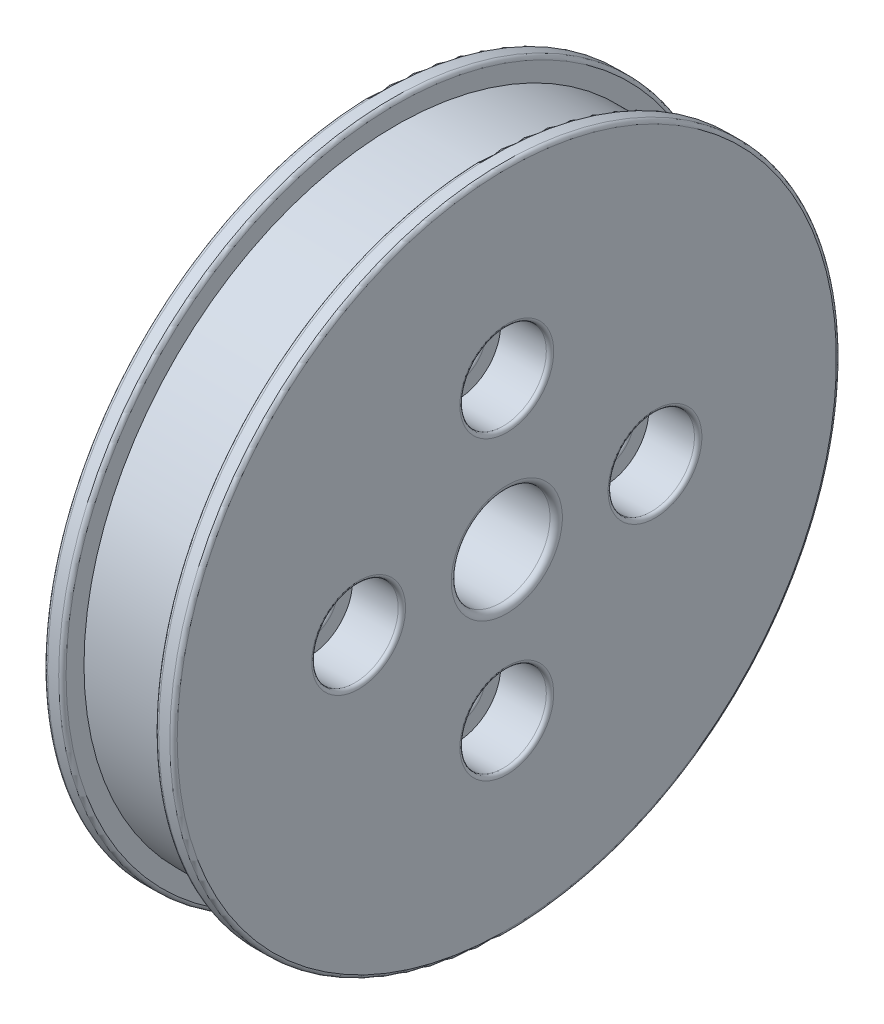
ISO-10303-21;
HEADER;
FILE_DESCRIPTION(('STEP AP214'),'2;1');
FILE_NAME('part.step','',(''),(''),'','','');
FILE_SCHEMA(('AUTOMOTIVE_DESIGN { 1 0 10303 214 1 1 1 1 }'));
ENDSEC;
DATA;
#1=APPLICATION_CONTEXT('core data for automotive mechanical design processes');
#2=APPLICATION_PROTOCOL_DEFINITION('international standard','automotive_design',2000,#1);
#3=PRODUCT_CONTEXT('',#1,'mechanical');
#4=PRODUCT('Part','Part','',(#3));
#5=PRODUCT_RELATED_PRODUCT_CATEGORY('part','',(#4));
#6=PRODUCT_DEFINITION_FORMATION('','',#4);
#7=PRODUCT_DEFINITION_CONTEXT('part definition',#1,'design');
#8=PRODUCT_DEFINITION('design','',#6,#7);
#9=PRODUCT_DEFINITION_SHAPE('','',#8);
#10=(LENGTH_UNIT() NAMED_UNIT(*) SI_UNIT(.MILLI.,.METRE.));
#11=(NAMED_UNIT(*) PLANE_ANGLE_UNIT() SI_UNIT($,.RADIAN.));
#12=(NAMED_UNIT(*) SI_UNIT($,.STERADIAN.) SOLID_ANGLE_UNIT());
#13=UNCERTAINTY_MEASURE_WITH_UNIT(LENGTH_MEASURE(1.E-05),#10,'distance_accuracy_value','');
#14=(GEOMETRIC_REPRESENTATION_CONTEXT(3) GLOBAL_UNCERTAINTY_ASSIGNED_CONTEXT((#13)) GLOBAL_UNIT_ASSIGNED_CONTEXT((#10,
#11,#12)) REPRESENTATION_CONTEXT('',''));
#15=CARTESIAN_POINT('',(0.,0.,0.));
#16=DIRECTION('',(0.,0.,1.));
#17=DIRECTION('',(1.,0.,0.));
#18=AXIS2_PLACEMENT_3D('',#15,#16,#17);
#19=CARTESIAN_POINT('',(0.,-12.,1.25693328198353E-13));
#20=DIRECTION('',(1.,0.,0.));
#21=DIRECTION('',(0.,0.,-1.));
#22=AXIS2_PLACEMENT_3D('',#19,#20,#21);
#23=CYLINDRICAL_SURFACE('',#22,2.);
#24=CARTESIAN_POINT('',(0.3,-12.,1.25693328198353E-13));
#25=DIRECTION('',(1.,0.,0.));
#26=DIRECTION('',(0.,0.,-1.));
#27=AXIS2_PLACEMENT_3D('',#24,#25,#26);
#28=CIRCLE('',#27,2.);
#29=CARTESIAN_POINT('',(0.3,-12.,-1.99999999999987));
#30=VERTEX_POINT('',#29);
#31=EDGE_CURVE('E85',#30,#30,#28,.F.);
#32=ORIENTED_EDGE('',*,*,#31,.T.);
#33=EDGE_LOOP('',(#32));
#34=FACE_BOUND('',#33,.T.);
#35=CARTESIAN_POINT('',(6.2,-12.,1.25693328198353E-13));
#36=DIRECTION('',(1.,0.,0.));
#37=DIRECTION('',(0.,0.,-1.));
#38=AXIS2_PLACEMENT_3D('',#35,#36,#37);
#39=CIRCLE('',#38,2.);
#40=CARTESIAN_POINT('',(6.2,-12.,-1.99999999999987));
#41=VERTEX_POINT('',#40);
#42=EDGE_CURVE('E88',#41,#41,#39,.T.);
#43=ORIENTED_EDGE('',*,*,#42,.T.);
#44=EDGE_LOOP('',(#43));
#45=FACE_BOUND('',#44,.T.);
#46=ADVANCED_FACE('F35',(#34,#45),#23,.F.);
#47=CARTESIAN_POINT('',(0.,0.,-12.));
#48=DIRECTION('',(1.,0.,0.));
#49=DIRECTION('',(0.,0.,-1.));
#50=AXIS2_PLACEMENT_3D('',#47,#48,#49);
#51=CYLINDRICAL_SURFACE('',#50,2.);
#52=CARTESIAN_POINT('',(0.3,0.,-12.));
#53=DIRECTION('',(1.,0.,0.));
#54=DIRECTION('',(0.,0.,-1.));
#55=AXIS2_PLACEMENT_3D('',#52,#53,#54);
#56=CIRCLE('',#55,2.);
#57=CARTESIAN_POINT('',(0.3,0.,-14.));
#58=VERTEX_POINT('',#57);
#59=EDGE_CURVE('E97',#58,#58,#56,.F.);
#60=ORIENTED_EDGE('',*,*,#59,.T.);
#61=EDGE_LOOP('',(#60));
#62=FACE_BOUND('',#61,.T.);
#63=CARTESIAN_POINT('',(6.2,0.,-12.));
#64=DIRECTION('',(1.,0.,0.));
#65=DIRECTION('',(0.,0.,-1.));
#66=AXIS2_PLACEMENT_3D('',#63,#64,#65);
#67=CIRCLE('',#66,2.);
#68=CARTESIAN_POINT('',(6.2,0.,-14.));
#69=VERTEX_POINT('',#68);
#70=EDGE_CURVE('E100',#69,#69,#67,.T.);
#71=ORIENTED_EDGE('',*,*,#70,.T.);
#72=EDGE_LOOP('',(#71));
#73=FACE_BOUND('',#72,.T.);
#74=ADVANCED_FACE('F189',(#62,#73),#51,.F.);
#75=CARTESIAN_POINT('',(0.,12.,0.));
#76=DIRECTION('',(1.,0.,0.));
#77=DIRECTION('',(0.,0.,-1.));
#78=AXIS2_PLACEMENT_3D('',#75,#76,#77);
#79=CYLINDRICAL_SURFACE('',#78,2.);
#80=CARTESIAN_POINT('',(0.3,12.,0.));
#81=DIRECTION('',(1.,0.,0.));
#82=DIRECTION('',(0.,0.,-1.));
#83=AXIS2_PLACEMENT_3D('',#80,#81,#82);
#84=CIRCLE('',#83,2.);
#85=CARTESIAN_POINT('',(0.3,12.,-2.00000000000004));
#86=VERTEX_POINT('',#85);
#87=EDGE_CURVE('E103',#86,#86,#84,.F.);
#88=ORIENTED_EDGE('',*,*,#87,.T.);
#89=EDGE_LOOP('',(#88));
#90=FACE_BOUND('',#89,.T.);
#91=CARTESIAN_POINT('',(6.2,12.,0.));
#92=DIRECTION('',(1.,0.,0.));
#93=DIRECTION('',(0.,0.,-1.));
#94=AXIS2_PLACEMENT_3D('',#91,#92,#93);
#95=CIRCLE('',#94,2.);
#96=CARTESIAN_POINT('',(6.2,12.,-2.00000000000004));
#97=VERTEX_POINT('',#96);
#98=EDGE_CURVE('E106',#97,#97,#95,.T.);
#99=ORIENTED_EDGE('',*,*,#98,.T.);
#100=EDGE_LOOP('',(#99));
#101=FACE_BOUND('',#100,.T.);
#102=ADVANCED_FACE('F195',(#90,#101),#79,.F.);
#103=CARTESIAN_POINT('',(0.,0.,12.));
#104=DIRECTION('',(1.,0.,0.));
#105=DIRECTION('',(0.,0.,-1.));
#106=AXIS2_PLACEMENT_3D('',#103,#104,#105);
#107=CYLINDRICAL_SURFACE('',#106,2.);
#108=CARTESIAN_POINT('',(0.3,0.,12.));
#109=DIRECTION('',(1.,0.,0.));
#110=DIRECTION('',(0.,0.,-1.));
#111=AXIS2_PLACEMENT_3D('',#108,#109,#110);
#112=CIRCLE('',#111,2.);
#113=CARTESIAN_POINT('',(0.3,0.,10.));
#114=VERTEX_POINT('',#113);
#115=EDGE_CURVE('E91',#114,#114,#112,.F.);
#116=ORIENTED_EDGE('',*,*,#115,.T.);
#117=EDGE_LOOP('',(#116));
#118=FACE_BOUND('',#117,.T.);
#119=CARTESIAN_POINT('',(6.2,0.,12.));
#120=DIRECTION('',(1.,0.,0.));
#121=DIRECTION('',(0.,0.,-1.));
#122=AXIS2_PLACEMENT_3D('',#119,#120,#121);
#123=CIRCLE('',#122,2.);
#124=CARTESIAN_POINT('',(6.2,0.,10.));
#125=VERTEX_POINT('',#124);
#126=EDGE_CURVE('E94',#125,#125,#123,.T.);
#127=ORIENTED_EDGE('',*,*,#126,.T.);
#128=EDGE_LOOP('',(#127));
#129=FACE_BOUND('',#128,.T.);
#130=ADVANCED_FACE('F231',(#118,#129),#107,.F.);
#131=CARTESIAN_POINT('',(0.,0.,0.));
#132=DIRECTION('',(-1.,0.,0.));
#133=DIRECTION('',(0.,0.,1.));
#134=AXIS2_PLACEMENT_3D('',#131,#132,#133);
#135=CYLINDRICAL_SURFACE('',#134,27.);
#136=CARTESIAN_POINT('',(9.3,0.,0.));
#137=DIRECTION('',(1.,0.,0.));
#138=DIRECTION('',(0.,0.,-1.));
#139=AXIS2_PLACEMENT_3D('',#136,#137,#138);
#140=CIRCLE('',#139,27.);
#141=CARTESIAN_POINT('',(9.3,0.,-27.));
#142=VERTEX_POINT('',#141);
#143=EDGE_CURVE('E124',#142,#142,#140,.T.);
#144=ORIENTED_EDGE('',*,*,#143,.T.);
#145=EDGE_LOOP('',(#144));
#146=FACE_BOUND('',#145,.T.);
#147=CARTESIAN_POINT('',(10.2,0.,0.));
#148=DIRECTION('',(-1.,0.,0.));
#149=DIRECTION('',(0.,0.,1.));
#150=AXIS2_PLACEMENT_3D('',#147,#148,#149);
#151=CIRCLE('',#150,27.);
#152=CARTESIAN_POINT('',(10.2,0.,27.));
#153=VERTEX_POINT('',#152);
#154=EDGE_CURVE('E127',#153,#153,#151,.T.);
#155=ORIENTED_EDGE('',*,*,#154,.T.);
#156=EDGE_LOOP('',(#155));
#157=FACE_BOUND('',#156,.T.);
#158=ADVANCED_FACE('F228',(#146,#157),#135,.T.);
#159=CARTESIAN_POINT('',(10.5,0.,-17.5));
#160=DIRECTION('',(-1.,0.,0.));
#161=DIRECTION('',(0.,0.,1.));
#162=AXIS2_PLACEMENT_3D('',#159,#160,#161);
#163=PLANE('',#162);
#164=CARTESIAN_POINT('',(10.5,0.,0.));
#165=DIRECTION('',(-1.,0.,0.));
#166=DIRECTION('',(0.,0.,1.));
#167=AXIS2_PLACEMENT_3D('',#164,#165,#166);
#168=CIRCLE('',#167,4.5);
#169=CARTESIAN_POINT('',(10.5,0.,4.5));
#170=VERTEX_POINT('',#169);
#171=EDGE_CURVE('E42',#170,#170,#168,.T.);
#172=ORIENTED_EDGE('',*,*,#171,.T.);
#173=EDGE_LOOP('',(#172));
#174=FACE_BOUND('',#173,.T.);
#175=CARTESIAN_POINT('',(10.5,-12.,1.25693328198353E-13));
#176=DIRECTION('',(-1.,0.,0.));
#177=DIRECTION('',(0.,0.,1.));
#178=AXIS2_PLACEMENT_3D('',#175,#176,#177);
#179=CIRCLE('',#178,3.8);
#180=CARTESIAN_POINT('',(10.5,-12.,3.80000000000013));
#181=VERTEX_POINT('',#180);
#182=EDGE_CURVE('E67',#181,#181,#179,.T.);
#183=ORIENTED_EDGE('',*,*,#182,.T.);
#184=EDGE_LOOP('',(#183));
#185=FACE_BOUND('',#184,.T.);
#186=CARTESIAN_POINT('',(10.5,0.,-12.));
#187=DIRECTION('',(-1.,0.,0.));
#188=DIRECTION('',(0.,0.,1.));
#189=AXIS2_PLACEMENT_3D('',#186,#187,#188);
#190=CIRCLE('',#189,3.8);
#191=CARTESIAN_POINT('',(10.5,0.,-8.2));
#192=VERTEX_POINT('',#191);
#193=EDGE_CURVE('E70',#192,#192,#190,.T.);
#194=ORIENTED_EDGE('',*,*,#193,.T.);
#195=EDGE_LOOP('',(#194));
#196=FACE_BOUND('',#195,.T.);
#197=CARTESIAN_POINT('',(10.5,0.,12.));
#198=DIRECTION('',(-1.,0.,0.));
#199=DIRECTION('',(0.,0.,1.));
#200=AXIS2_PLACEMENT_3D('',#197,#198,#199);
#201=CIRCLE('',#200,3.8);
#202=CARTESIAN_POINT('',(10.5,0.,15.8));
#203=VERTEX_POINT('',#202);
#204=EDGE_CURVE('E73',#203,#203,#201,.T.);
#205=ORIENTED_EDGE('',*,*,#204,.T.);
#206=EDGE_LOOP('',(#205));
#207=FACE_BOUND('',#206,.T.);
#208=CARTESIAN_POINT('',(10.5,12.,0.));
#209=DIRECTION('',(-1.,0.,0.));
#210=DIRECTION('',(0.,0.,1.));
#211=AXIS2_PLACEMENT_3D('',#208,#209,#210);
#212=CIRCLE('',#211,3.8);
#213=CARTESIAN_POINT('',(10.5,12.,3.79999999999996));
#214=VERTEX_POINT('',#213);
#215=EDGE_CURVE('E76',#214,#214,#212,.T.);
#216=ORIENTED_EDGE('',*,*,#215,.T.);
#217=EDGE_LOOP('',(#216));
#218=FACE_BOUND('',#217,.T.);
#219=CARTESIAN_POINT('',(10.5,0.,0.));
#220=DIRECTION('',(-1.,0.,0.));
#221=DIRECTION('',(0.,0.,1.));
#222=AXIS2_PLACEMENT_3D('',#219,#220,#221);
#223=CIRCLE('',#222,26.7);
#224=CARTESIAN_POINT('',(10.5,0.,26.7));
#225=VERTEX_POINT('',#224);
#226=EDGE_CURVE('E121',#225,#225,#223,.F.);
#227=ORIENTED_EDGE('',*,*,#226,.T.);
#228=EDGE_LOOP('',(#227));
#229=FACE_BOUND('',#228,.T.);
#230=ADVANCED_FACE('F225',(#174,#185,#196,#207,#218,#229),#163,.F.);
#231=CARTESIAN_POINT('',(0.,0.,0.));
#232=DIRECTION('',(-1.,0.,0.));
#233=DIRECTION('',(0.,0.,1.));
#234=AXIS2_PLACEMENT_3D('',#231,#232,#233);
#235=CYLINDRICAL_SURFACE('',#234,4.);
#236=CARTESIAN_POINT('',(10.,0.,0.));
#237=DIRECTION('',(-1.,0.,0.));
#238=DIRECTION('',(0.,0.,1.));
#239=AXIS2_PLACEMENT_3D('',#236,#237,#238);
#240=CIRCLE('',#239,4.);
#241=CARTESIAN_POINT('',(10.,0.,4.));
#242=VERTEX_POINT('',#241);
#243=EDGE_CURVE('E10',#242,#242,#240,.F.);
#244=ORIENTED_EDGE('',*,*,#243,.T.);
#245=EDGE_LOOP('',(#244));
#246=FACE_BOUND('',#245,.T.);
#247=CARTESIAN_POINT('',(0.3,0.,0.));
#248=DIRECTION('',(1.,0.,0.));
#249=DIRECTION('',(0.,0.,-1.));
#250=AXIS2_PLACEMENT_3D('',#247,#248,#249);
#251=CIRCLE('',#250,4.);
#252=CARTESIAN_POINT('',(0.3,0.,-4.));
#253=VERTEX_POINT('',#252);
#254=EDGE_CURVE('E148',#253,#253,#251,.F.);
#255=ORIENTED_EDGE('',*,*,#254,.T.);
#256=EDGE_LOOP('',(#255));
#257=FACE_BOUND('',#256,.T.);
#258=ADVANCED_FACE('F221',(#246,#257),#235,.F.);
#259=CARTESIAN_POINT('',(0.,0.,-4.));
#260=DIRECTION('',(1.,0.,0.));
#261=DIRECTION('',(0.,0.,-1.));
#262=AXIS2_PLACEMENT_3D('',#259,#260,#261);
#263=PLANE('',#262);
#264=CARTESIAN_POINT('',(0.,12.,0.));
#265=DIRECTION('',(1.,0.,0.));
#266=DIRECTION('',(0.,0.,-1.));
#267=AXIS2_PLACEMENT_3D('',#264,#265,#266);
#268=CIRCLE('',#267,2.3);
#269=CARTESIAN_POINT('',(0.,12.,-2.30000000000004));
#270=VERTEX_POINT('',#269);
#271=EDGE_CURVE('E109',#270,#270,#268,.T.);
#272=ORIENTED_EDGE('',*,*,#271,.T.);
#273=EDGE_LOOP('',(#272));
#274=FACE_BOUND('',#273,.T.);
#275=CARTESIAN_POINT('',(0.,0.,-12.));
#276=DIRECTION('',(1.,0.,0.));
#277=DIRECTION('',(0.,0.,-1.));
#278=AXIS2_PLACEMENT_3D('',#275,#276,#277);
#279=CIRCLE('',#278,2.3);
#280=CARTESIAN_POINT('',(0.,0.,-14.3));
#281=VERTEX_POINT('',#280);
#282=EDGE_CURVE('E112',#281,#281,#279,.T.);
#283=ORIENTED_EDGE('',*,*,#282,.T.);
#284=EDGE_LOOP('',(#283));
#285=FACE_BOUND('',#284,.T.);
#286=CARTESIAN_POINT('',(0.,0.,12.));
#287=DIRECTION('',(1.,0.,0.));
#288=DIRECTION('',(0.,0.,-1.));
#289=AXIS2_PLACEMENT_3D('',#286,#287,#288);
#290=CIRCLE('',#289,2.3);
#291=CARTESIAN_POINT('',(0.,0.,9.7));
#292=VERTEX_POINT('',#291);
#293=EDGE_CURVE('E115',#292,#292,#290,.T.);
#294=ORIENTED_EDGE('',*,*,#293,.T.);
#295=EDGE_LOOP('',(#294));
#296=FACE_BOUND('',#295,.T.);
#297=CARTESIAN_POINT('',(0.,-12.,1.25693328198353E-13));
#298=DIRECTION('',(1.,0.,0.));
#299=DIRECTION('',(0.,0.,-1.));
#300=AXIS2_PLACEMENT_3D('',#297,#298,#299);
#301=CIRCLE('',#300,2.3);
#302=CARTESIAN_POINT('',(0.,-12.,-2.29999999999987));
#303=VERTEX_POINT('',#302);
#304=EDGE_CURVE('E118',#303,#303,#301,.T.);
#305=ORIENTED_EDGE('',*,*,#304,.T.);
#306=EDGE_LOOP('',(#305));
#307=FACE_BOUND('',#306,.T.);
#308=CARTESIAN_POINT('',(0.,0.,0.));
#309=DIRECTION('',(1.,0.,0.));
#310=DIRECTION('',(0.,0.,-1.));
#311=AXIS2_PLACEMENT_3D('',#308,#309,#310);
#312=CIRCLE('',#311,4.3);
#313=CARTESIAN_POINT('',(0.,0.,-4.3));
#314=VERTEX_POINT('',#313);
#315=EDGE_CURVE('E142',#314,#314,#312,.T.);
#316=ORIENTED_EDGE('',*,*,#315,.T.);
#317=EDGE_LOOP('',(#316));
#318=FACE_BOUND('',#317,.T.);
#319=CARTESIAN_POINT('',(0.,0.,0.));
#320=DIRECTION('',(1.,0.,0.));
#321=DIRECTION('',(0.,0.,-1.));
#322=AXIS2_PLACEMENT_3D('',#319,#320,#321);
#323=CIRCLE('',#322,26.7);
#324=CARTESIAN_POINT('',(0.,0.,-26.7));
#325=VERTEX_POINT('',#324);
#326=EDGE_CURVE('E145',#325,#325,#323,.F.);
#327=ORIENTED_EDGE('',*,*,#326,.T.);
#328=EDGE_LOOP('',(#327));
#329=FACE_BOUND('',#328,.T.);
#330=ADVANCED_FACE('F217',(#274,#285,#296,#307,#318,#329),#263,.F.);
#331=CARTESIAN_POINT('',(0.,0.,0.));
#332=DIRECTION('',(-1.,0.,0.));
#333=DIRECTION('',(0.,0.,1.));
#334=AXIS2_PLACEMENT_3D('',#331,#332,#333);
#335=CYLINDRICAL_SURFACE('',#334,27.);
#336=CARTESIAN_POINT('',(0.3,0.,0.));
#337=DIRECTION('',(1.,0.,0.));
#338=DIRECTION('',(0.,0.,-1.));
#339=AXIS2_PLACEMENT_3D('',#336,#337,#338);
#340=CIRCLE('',#339,27.);
#341=CARTESIAN_POINT('',(0.3,0.,-27.));
#342=VERTEX_POINT('',#341);
#343=EDGE_CURVE('E136',#342,#342,#340,.T.);
#344=ORIENTED_EDGE('',*,*,#343,.T.);
#345=EDGE_LOOP('',(#344));
#346=FACE_BOUND('',#345,.T.);
#347=CARTESIAN_POINT('',(1.2,0.,0.));
#348=DIRECTION('',(-1.,0.,0.));
#349=DIRECTION('',(0.,0.,1.));
#350=AXIS2_PLACEMENT_3D('',#347,#348,#349);
#351=CIRCLE('',#350,27.);
#352=CARTESIAN_POINT('',(1.2,0.,27.));
#353=VERTEX_POINT('',#352);
#354=EDGE_CURVE('E139',#353,#353,#351,.T.);
#355=ORIENTED_EDGE('',*,*,#354,.T.);
#356=EDGE_LOOP('',(#355));
#357=FACE_BOUND('',#356,.T.);
#358=ADVANCED_FACE('F213',(#346,#357),#335,.T.);
#359=CARTESIAN_POINT('',(1.5,0.,-27.));
#360=DIRECTION('',(-1.,0.,0.));
#361=DIRECTION('',(0.,0.,1.));
#362=AXIS2_PLACEMENT_3D('',#359,#360,#361);
#363=PLANE('',#362);
#364=CARTESIAN_POINT('',(1.5,0.,0.));
#365=DIRECTION('',(-1.,0.,0.));
#366=DIRECTION('',(0.,0.,1.));
#367=AXIS2_PLACEMENT_3D('',#364,#365,#366);
#368=CIRCLE('',#367,26.7);
#369=CARTESIAN_POINT('',(1.5,0.,26.7));
#370=VERTEX_POINT('',#369);
#371=EDGE_CURVE('E133',#370,#370,#368,.F.);
#372=ORIENTED_EDGE('',*,*,#371,.T.);
#373=EDGE_LOOP('',(#372));
#374=FACE_BOUND('',#373,.T.);
#375=CARTESIAN_POINT('',(1.5,0.,0.));
#376=DIRECTION('',(-1.,0.,0.));
#377=DIRECTION('',(0.,0.,1.));
#378=AXIS2_PLACEMENT_3D('',#375,#376,#377);
#379=CIRCLE('',#378,25.25);
#380=CARTESIAN_POINT('',(1.5,0.,25.25));
#381=VERTEX_POINT('',#380);
#382=EDGE_CURVE('E151',#381,#381,#379,.T.);
#383=ORIENTED_EDGE('',*,*,#382,.T.);
#384=EDGE_LOOP('',(#383));
#385=FACE_BOUND('',#384,.T.);
#386=ADVANCED_FACE('F209',(#374,#385),#363,.F.);
#387=CARTESIAN_POINT('',(0.,0.,0.));
#388=DIRECTION('',(-1.,0.,0.));
#389=DIRECTION('',(0.,0.,1.));
#390=AXIS2_PLACEMENT_3D('',#387,#388,#389);
#391=CYLINDRICAL_SURFACE('',#390,25.25);
#392=ORIENTED_EDGE('',*,*,#382,.F.);
#393=EDGE_LOOP('',(#392));
#394=FACE_BOUND('',#393,.T.);
#395=CARTESIAN_POINT('',(9.,0.,0.));
#396=DIRECTION('',(-1.,0.,0.));
#397=DIRECTION('',(0.,0.,1.));
#398=AXIS2_PLACEMENT_3D('',#395,#396,#397);
#399=CIRCLE('',#398,25.25);
#400=CARTESIAN_POINT('',(9.,0.,25.25));
#401=VERTEX_POINT('',#400);
#402=EDGE_CURVE('E154',#401,#401,#399,.T.);
#403=ORIENTED_EDGE('',*,*,#402,.T.);
#404=EDGE_LOOP('',(#403));
#405=FACE_BOUND('',#404,.T.);
#406=ADVANCED_FACE('F205',(#394,#405),#391,.T.);
#407=CARTESIAN_POINT('',(9.,0.,-25.25));
#408=DIRECTION('',(1.,0.,0.));
#409=DIRECTION('',(0.,0.,-1.));
#410=AXIS2_PLACEMENT_3D('',#407,#408,#409);
#411=PLANE('',#410);
#412=CARTESIAN_POINT('',(9.,0.,0.));
#413=DIRECTION('',(1.,0.,0.));
#414=DIRECTION('',(0.,0.,-1.));
#415=AXIS2_PLACEMENT_3D('',#412,#413,#414);
#416=CIRCLE('',#415,26.7);
#417=CARTESIAN_POINT('',(9.,0.,-26.7));
#418=VERTEX_POINT('',#417);
#419=EDGE_CURVE('E130',#418,#418,#416,.F.);
#420=ORIENTED_EDGE('',*,*,#419,.T.);
#421=EDGE_LOOP('',(#420));
#422=FACE_BOUND('',#421,.T.);
#423=ORIENTED_EDGE('',*,*,#402,.F.);
#424=EDGE_LOOP('',(#423));
#425=FACE_BOUND('',#424,.T.);
#426=ADVANCED_FACE('F201',(#422,#425),#411,.F.);
#427=CARTESIAN_POINT('',(0.3,0.,0.));
#428=DIRECTION('',(1.,0.,0.));
#429=DIRECTION('',(0.,0.,-1.));
#430=AXIS2_PLACEMENT_3D('',#427,#428,#429);
#431=TOROIDAL_SURFACE('',#430,4.3,0.3);
#432=ORIENTED_EDGE('',*,*,#315,.F.);
#433=EDGE_LOOP('',(#432));
#434=FACE_BOUND('',#433,.T.);
#435=ORIENTED_EDGE('',*,*,#254,.F.);
#436=EDGE_LOOP('',(#435));
#437=FACE_BOUND('',#436,.T.);
#438=ADVANCED_FACE('F204',(#434,#437),#431,.T.);
#439=CARTESIAN_POINT('',(0.3,0.,0.));
#440=DIRECTION('',(1.,0.,0.));
#441=DIRECTION('',(0.,0.,-1.));
#442=AXIS2_PLACEMENT_3D('',#439,#440,#441);
#443=TOROIDAL_SURFACE('',#442,26.7,0.3);
#444=ORIENTED_EDGE('',*,*,#343,.F.);
#445=EDGE_LOOP('',(#444));
#446=FACE_BOUND('',#445,.T.);
#447=ORIENTED_EDGE('',*,*,#326,.F.);
#448=EDGE_LOOP('',(#447));
#449=FACE_BOUND('',#448,.T.);
#450=ADVANCED_FACE('F235',(#446,#449),#443,.T.);
#451=CARTESIAN_POINT('',(1.2,0.,0.));
#452=DIRECTION('',(-1.,0.,0.));
#453=DIRECTION('',(0.,0.,1.));
#454=AXIS2_PLACEMENT_3D('',#451,#452,#453);
#455=TOROIDAL_SURFACE('',#454,26.7,0.3);
#456=ORIENTED_EDGE('',*,*,#371,.F.);
#457=EDGE_LOOP('',(#456));
#458=FACE_BOUND('',#457,.T.);
#459=ORIENTED_EDGE('',*,*,#354,.F.);
#460=EDGE_LOOP('',(#459));
#461=FACE_BOUND('',#460,.T.);
#462=ADVANCED_FACE('F239',(#458,#461),#455,.T.);
#463=CARTESIAN_POINT('',(9.3,0.,0.));
#464=DIRECTION('',(1.,0.,0.));
#465=DIRECTION('',(0.,0.,-1.));
#466=AXIS2_PLACEMENT_3D('',#463,#464,#465);
#467=TOROIDAL_SURFACE('',#466,26.7,0.3);
#468=ORIENTED_EDGE('',*,*,#143,.F.);
#469=EDGE_LOOP('',(#468));
#470=FACE_BOUND('',#469,.T.);
#471=ORIENTED_EDGE('',*,*,#419,.F.);
#472=EDGE_LOOP('',(#471));
#473=FACE_BOUND('',#472,.T.);
#474=ADVANCED_FACE('F243',(#470,#473),#467,.T.);
#475=CARTESIAN_POINT('',(10.2,0.,0.));
#476=DIRECTION('',(-1.,0.,0.));
#477=DIRECTION('',(0.,0.,1.));
#478=AXIS2_PLACEMENT_3D('',#475,#476,#477);
#479=TOROIDAL_SURFACE('',#478,26.7,0.3);
#480=ORIENTED_EDGE('',*,*,#226,.F.);
#481=EDGE_LOOP('',(#480));
#482=FACE_BOUND('',#481,.T.);
#483=ORIENTED_EDGE('',*,*,#154,.F.);
#484=EDGE_LOOP('',(#483));
#485=FACE_BOUND('',#484,.T.);
#486=ADVANCED_FACE('F184',(#482,#485),#479,.T.);
#487=CARTESIAN_POINT('',(6.5,0.,12.));
#488=DIRECTION('',(1.,0.,0.));
#489=DIRECTION('',(0.,0.,-1.));
#490=AXIS2_PLACEMENT_3D('',#487,#488,#489);
#491=PLANE('',#490);
#492=CARTESIAN_POINT('',(6.5,0.,12.));
#493=DIRECTION('',(1.,0.,0.));
#494=DIRECTION('',(0.,0.,-1.));
#495=AXIS2_PLACEMENT_3D('',#492,#493,#494);
#496=CIRCLE('',#495,2.3);
#497=CARTESIAN_POINT('',(6.5,0.,9.7));
#498=VERTEX_POINT('',#497);
#499=EDGE_CURVE('E58',#498,#498,#496,.F.);
#500=ORIENTED_EDGE('',*,*,#499,.T.);
#501=EDGE_LOOP('',(#500));
#502=FACE_BOUND('',#501,.T.);
#503=CARTESIAN_POINT('',(6.5,0.,12.));
#504=DIRECTION('',(1.,0.,0.));
#505=DIRECTION('',(0.,0.,-1.));
#506=AXIS2_PLACEMENT_3D('',#503,#504,#505);
#507=CIRCLE('',#506,3.5);
#508=CARTESIAN_POINT('',(6.5,0.,8.5));
#509=VERTEX_POINT('',#508);
#510=EDGE_CURVE('E157',#509,#509,#507,.T.);
#511=ORIENTED_EDGE('',*,*,#510,.T.);
#512=EDGE_LOOP('',(#511));
#513=FACE_BOUND('',#512,.T.);
#514=ADVANCED_FACE('F170',(#502,#513),#491,.T.);
#515=CARTESIAN_POINT('',(6.5,0.,12.));
#516=DIRECTION('',(1.,0.,0.));
#517=DIRECTION('',(0.,0.,-1.));
#518=AXIS2_PLACEMENT_3D('',#515,#516,#517);
#519=CYLINDRICAL_SURFACE('',#518,3.5);
#520=CARTESIAN_POINT('',(10.2,0.,12.));
#521=DIRECTION('',(-1.,0.,0.));
#522=DIRECTION('',(0.,0.,1.));
#523=AXIS2_PLACEMENT_3D('',#520,#521,#522);
#524=CIRCLE('',#523,3.5);
#525=CARTESIAN_POINT('',(10.2,0.,15.5));
#526=VERTEX_POINT('',#525);
#527=EDGE_CURVE('E55',#526,#526,#524,.F.);
#528=ORIENTED_EDGE('',*,*,#527,.T.);
#529=EDGE_LOOP('',(#528));
#530=FACE_BOUND('',#529,.T.);
#531=ORIENTED_EDGE('',*,*,#510,.F.);
#532=EDGE_LOOP('',(#531));
#533=FACE_BOUND('',#532,.T.);
#534=ADVANCED_FACE('F172',(#530,#533),#519,.F.);
#535=CARTESIAN_POINT('',(6.5,12.,0.));
#536=DIRECTION('',(1.,0.,0.));
#537=DIRECTION('',(0.,0.,-1.));
#538=AXIS2_PLACEMENT_3D('',#535,#536,#537);
#539=PLANE('',#538);
#540=CARTESIAN_POINT('',(6.5,12.,0.));
#541=DIRECTION('',(1.,0.,0.));
#542=DIRECTION('',(0.,0.,-1.));
#543=AXIS2_PLACEMENT_3D('',#540,#541,#542);
#544=CIRCLE('',#543,2.3);
#545=CARTESIAN_POINT('',(6.5,12.,-2.30000000000004));
#546=VERTEX_POINT('',#545);
#547=EDGE_CURVE('E50',#546,#546,#544,.F.);
#548=ORIENTED_EDGE('',*,*,#547,.T.);
#549=EDGE_LOOP('',(#548));
#550=FACE_BOUND('',#549,.T.);
#551=CARTESIAN_POINT('',(6.5,12.,0.));
#552=DIRECTION('',(1.,0.,0.));
#553=DIRECTION('',(0.,0.,-1.));
#554=AXIS2_PLACEMENT_3D('',#551,#552,#553);
#555=CIRCLE('',#554,3.5);
#556=CARTESIAN_POINT('',(6.5,12.,-3.50000000000004));
#557=VERTEX_POINT('',#556);
#558=EDGE_CURVE('E158',#557,#557,#555,.T.);
#559=ORIENTED_EDGE('',*,*,#558,.T.);
#560=EDGE_LOOP('',(#559));
#561=FACE_BOUND('',#560,.T.);
#562=ADVANCED_FACE('F174',(#550,#561),#539,.T.);
#563=CARTESIAN_POINT('',(6.5,12.,0.));
#564=DIRECTION('',(1.,0.,0.));
#565=DIRECTION('',(0.,0.,-1.));
#566=AXIS2_PLACEMENT_3D('',#563,#564,#565);
#567=CYLINDRICAL_SURFACE('',#566,3.5);
#568=CARTESIAN_POINT('',(10.2,12.,0.));
#569=DIRECTION('',(-1.,0.,0.));
#570=DIRECTION('',(0.,0.,1.));
#571=AXIS2_PLACEMENT_3D('',#568,#569,#570);
#572=CIRCLE('',#571,3.5);
#573=CARTESIAN_POINT('',(10.2,12.,3.49999999999996));
#574=VERTEX_POINT('',#573);
#575=EDGE_CURVE('E46',#574,#574,#572,.F.);
#576=ORIENTED_EDGE('',*,*,#575,.T.);
#577=EDGE_LOOP('',(#576));
#578=FACE_BOUND('',#577,.T.);
#579=ORIENTED_EDGE('',*,*,#558,.F.);
#580=EDGE_LOOP('',(#579));
#581=FACE_BOUND('',#580,.T.);
#582=ADVANCED_FACE('F181',(#578,#581),#567,.F.);
#583=CARTESIAN_POINT('',(6.5,0.,-12.));
#584=DIRECTION('',(1.,0.,0.));
#585=DIRECTION('',(0.,0.,-1.));
#586=AXIS2_PLACEMENT_3D('',#583,#584,#585);
#587=PLANE('',#586);
#588=CARTESIAN_POINT('',(6.5,0.,-12.));
#589=DIRECTION('',(1.,0.,0.));
#590=DIRECTION('',(0.,0.,-1.));
#591=AXIS2_PLACEMENT_3D('',#588,#589,#590);
#592=CIRCLE('',#591,2.3);
#593=CARTESIAN_POINT('',(6.5,0.,-14.3));
#594=VERTEX_POINT('',#593);
#595=EDGE_CURVE('E64',#594,#594,#592,.F.);
#596=ORIENTED_EDGE('',*,*,#595,.T.);
#597=EDGE_LOOP('',(#596));
#598=FACE_BOUND('',#597,.T.);
#599=CARTESIAN_POINT('',(6.5,0.,-12.));
#600=DIRECTION('',(1.,0.,0.));
#601=DIRECTION('',(0.,0.,-1.));
#602=AXIS2_PLACEMENT_3D('',#599,#600,#601);
#603=CIRCLE('',#602,3.5);
#604=CARTESIAN_POINT('',(6.5,0.,-15.5));
#605=VERTEX_POINT('',#604);
#606=EDGE_CURVE('E161',#605,#605,#603,.T.);
#607=ORIENTED_EDGE('',*,*,#606,.T.);
#608=EDGE_LOOP('',(#607));
#609=FACE_BOUND('',#608,.T.);
#610=ADVANCED_FACE('F308',(#598,#609),#587,.T.);
#611=CARTESIAN_POINT('',(6.5,0.,-12.));
#612=DIRECTION('',(1.,0.,0.));
#613=DIRECTION('',(0.,0.,-1.));
#614=AXIS2_PLACEMENT_3D('',#611,#612,#613);
#615=CYLINDRICAL_SURFACE('',#614,3.5);
#616=CARTESIAN_POINT('',(10.2,0.,-12.));
#617=DIRECTION('',(-1.,0.,0.));
#618=DIRECTION('',(0.,0.,1.));
#619=AXIS2_PLACEMENT_3D('',#616,#617,#618);
#620=CIRCLE('',#619,3.5);
#621=CARTESIAN_POINT('',(10.2,0.,-8.5));
#622=VERTEX_POINT('',#621);
#623=EDGE_CURVE('E61',#622,#622,#620,.F.);
#624=ORIENTED_EDGE('',*,*,#623,.T.);
#625=EDGE_LOOP('',(#624));
#626=FACE_BOUND('',#625,.T.);
#627=ORIENTED_EDGE('',*,*,#606,.F.);
#628=EDGE_LOOP('',(#627));
#629=FACE_BOUND('',#628,.T.);
#630=ADVANCED_FACE('F315',(#626,#629),#615,.F.);
#631=CARTESIAN_POINT('',(6.5,-12.,1.25693328198353E-13));
#632=DIRECTION('',(1.,0.,0.));
#633=DIRECTION('',(0.,0.,-1.));
#634=AXIS2_PLACEMENT_3D('',#631,#632,#633);
#635=PLANE('',#634);
#636=CARTESIAN_POINT('',(6.5,-12.,1.25693328198353E-13));
#637=DIRECTION('',(1.,0.,0.));
#638=DIRECTION('',(0.,0.,-1.));
#639=AXIS2_PLACEMENT_3D('',#636,#637,#638);
#640=CIRCLE('',#639,2.3);
#641=CARTESIAN_POINT('',(6.5,-12.,-2.29999999999987));
#642=VERTEX_POINT('',#641);
#643=EDGE_CURVE('E82',#642,#642,#640,.F.);
#644=ORIENTED_EDGE('',*,*,#643,.T.);
#645=EDGE_LOOP('',(#644));
#646=FACE_BOUND('',#645,.T.);
#647=CARTESIAN_POINT('',(6.5,-12.,1.25693328198353E-13));
#648=DIRECTION('',(1.,0.,0.));
#649=DIRECTION('',(0.,0.,-1.));
#650=AXIS2_PLACEMENT_3D('',#647,#648,#649);
#651=CIRCLE('',#650,3.5);
#652=CARTESIAN_POINT('',(6.5,-12.,-3.49999999999987));
#653=VERTEX_POINT('',#652);
#654=EDGE_CURVE('E164',#653,#653,#651,.T.);
#655=ORIENTED_EDGE('',*,*,#654,.T.);
#656=EDGE_LOOP('',(#655));
#657=FACE_BOUND('',#656,.T.);
#658=ADVANCED_FACE('F443',(#646,#657),#635,.T.);
#659=CARTESIAN_POINT('',(6.5,-12.,1.25693328198353E-13));
#660=DIRECTION('',(1.,0.,0.));
#661=DIRECTION('',(0.,0.,-1.));
#662=AXIS2_PLACEMENT_3D('',#659,#660,#661);
#663=CYLINDRICAL_SURFACE('',#662,3.5);
#664=CARTESIAN_POINT('',(10.2,-12.,1.25693328198353E-13));
#665=DIRECTION('',(-1.,0.,0.));
#666=DIRECTION('',(0.,0.,1.));
#667=AXIS2_PLACEMENT_3D('',#664,#665,#666);
#668=CIRCLE('',#667,3.5);
#669=CARTESIAN_POINT('',(10.2,-12.,3.50000000000013));
#670=VERTEX_POINT('',#669);
#671=EDGE_CURVE('E79',#670,#670,#668,.F.);
#672=ORIENTED_EDGE('',*,*,#671,.T.);
#673=EDGE_LOOP('',(#672));
#674=FACE_BOUND('',#673,.T.);
#675=ORIENTED_EDGE('',*,*,#654,.F.);
#676=EDGE_LOOP('',(#675));
#677=FACE_BOUND('',#676,.T.);
#678=ADVANCED_FACE('F255',(#674,#677),#663,.F.);
#679=CARTESIAN_POINT('',(0.3,12.,0.));
#680=DIRECTION('',(1.,0.,0.));
#681=DIRECTION('',(0.,0.,-1.));
#682=AXIS2_PLACEMENT_3D('',#679,#680,#681);
#683=TOROIDAL_SURFACE('',#682,2.3,0.3);
#684=ORIENTED_EDGE('',*,*,#87,.F.);
#685=EDGE_LOOP('',(#684));
#686=FACE_BOUND('',#685,.T.);
#687=ORIENTED_EDGE('',*,*,#271,.F.);
#688=EDGE_LOOP('',(#687));
#689=FACE_BOUND('',#688,.T.);
#690=ADVANCED_FACE('F251',(#686,#689),#683,.T.);
#691=CARTESIAN_POINT('',(0.3,0.,-12.));
#692=DIRECTION('',(1.,0.,0.));
#693=DIRECTION('',(0.,0.,-1.));
#694=AXIS2_PLACEMENT_3D('',#691,#692,#693);
#695=TOROIDAL_SURFACE('',#694,2.3,0.3);
#696=ORIENTED_EDGE('',*,*,#59,.F.);
#697=EDGE_LOOP('',(#696));
#698=FACE_BOUND('',#697,.T.);
#699=ORIENTED_EDGE('',*,*,#282,.F.);
#700=EDGE_LOOP('',(#699));
#701=FACE_BOUND('',#700,.T.);
#702=ADVANCED_FACE('F254',(#698,#701),#695,.T.);
#703=CARTESIAN_POINT('',(0.3,0.,12.));
#704=DIRECTION('',(1.,0.,0.));
#705=DIRECTION('',(0.,0.,-1.));
#706=AXIS2_PLACEMENT_3D('',#703,#704,#705);
#707=TOROIDAL_SURFACE('',#706,2.3,0.3);
#708=ORIENTED_EDGE('',*,*,#115,.F.);
#709=EDGE_LOOP('',(#708));
#710=FACE_BOUND('',#709,.T.);
#711=ORIENTED_EDGE('',*,*,#293,.F.);
#712=EDGE_LOOP('',(#711));
#713=FACE_BOUND('',#712,.T.);
#714=ADVANCED_FACE('F259',(#710,#713),#707,.T.);
#715=CARTESIAN_POINT('',(0.3,-12.,1.25693328198353E-13));
#716=DIRECTION('',(1.,0.,0.));
#717=DIRECTION('',(0.,0.,-1.));
#718=AXIS2_PLACEMENT_3D('',#715,#716,#717);
#719=TOROIDAL_SURFACE('',#718,2.3,0.3);
#720=ORIENTED_EDGE('',*,*,#31,.F.);
#721=EDGE_LOOP('',(#720));
#722=FACE_BOUND('',#721,.T.);
#723=ORIENTED_EDGE('',*,*,#304,.F.);
#724=EDGE_LOOP('',(#723));
#725=FACE_BOUND('',#724,.T.);
#726=ADVANCED_FACE('F263',(#722,#725),#719,.T.);
#727=CARTESIAN_POINT('',(6.2,-12.,1.25693328198353E-13));
#728=DIRECTION('',(1.,0.,0.));
#729=DIRECTION('',(0.,0.,-1.));
#730=AXIS2_PLACEMENT_3D('',#727,#728,#729);
#731=TOROIDAL_SURFACE('',#730,2.3,0.3);
#732=ORIENTED_EDGE('',*,*,#42,.F.);
#733=EDGE_LOOP('',(#732));
#734=FACE_BOUND('',#733,.T.);
#735=ORIENTED_EDGE('',*,*,#643,.F.);
#736=EDGE_LOOP('',(#735));
#737=FACE_BOUND('',#736,.T.);
#738=ADVANCED_FACE('F267',(#734,#737),#731,.T.);
#739=CARTESIAN_POINT('',(10.2,-12.,1.25693328198353E-13));
#740=DIRECTION('',(-1.,0.,0.));
#741=DIRECTION('',(0.,0.,1.));
#742=AXIS2_PLACEMENT_3D('',#739,#740,#741);
#743=TOROIDAL_SURFACE('',#742,3.8,0.3);
#744=ORIENTED_EDGE('',*,*,#182,.F.);
#745=EDGE_LOOP('',(#744));
#746=FACE_BOUND('',#745,.T.);
#747=ORIENTED_EDGE('',*,*,#671,.F.);
#748=EDGE_LOOP('',(#747));
#749=FACE_BOUND('',#748,.T.);
#750=ADVANCED_FACE('F271',(#746,#749),#743,.T.);
#751=CARTESIAN_POINT('',(6.2,0.,-12.));
#752=DIRECTION('',(1.,0.,0.));
#753=DIRECTION('',(0.,0.,-1.));
#754=AXIS2_PLACEMENT_3D('',#751,#752,#753);
#755=TOROIDAL_SURFACE('',#754,2.3,0.3);
#756=ORIENTED_EDGE('',*,*,#70,.F.);
#757=EDGE_LOOP('',(#756));
#758=FACE_BOUND('',#757,.T.);
#759=ORIENTED_EDGE('',*,*,#595,.F.);
#760=EDGE_LOOP('',(#759));
#761=FACE_BOUND('',#760,.T.);
#762=ADVANCED_FACE('F275',(#758,#761),#755,.T.);
#763=CARTESIAN_POINT('',(10.2,0.,-12.));
#764=DIRECTION('',(-1.,0.,0.));
#765=DIRECTION('',(0.,0.,1.));
#766=AXIS2_PLACEMENT_3D('',#763,#764,#765);
#767=TOROIDAL_SURFACE('',#766,3.8,0.3);
#768=ORIENTED_EDGE('',*,*,#193,.F.);
#769=EDGE_LOOP('',(#768));
#770=FACE_BOUND('',#769,.T.);
#771=ORIENTED_EDGE('',*,*,#623,.F.);
#772=EDGE_LOOP('',(#771));
#773=FACE_BOUND('',#772,.T.);
#774=ADVANCED_FACE('F279',(#770,#773),#767,.T.);
#775=CARTESIAN_POINT('',(6.2,0.,12.));
#776=DIRECTION('',(1.,0.,0.));
#777=DIRECTION('',(0.,0.,-1.));
#778=AXIS2_PLACEMENT_3D('',#775,#776,#777);
#779=TOROIDAL_SURFACE('',#778,2.3,0.3);
#780=ORIENTED_EDGE('',*,*,#126,.F.);
#781=EDGE_LOOP('',(#780));
#782=FACE_BOUND('',#781,.T.);
#783=ORIENTED_EDGE('',*,*,#499,.F.);
#784=EDGE_LOOP('',(#783));
#785=FACE_BOUND('',#784,.T.);
#786=ADVANCED_FACE('F283',(#782,#785),#779,.T.);
#787=CARTESIAN_POINT('',(10.2,0.,12.));
#788=DIRECTION('',(-1.,0.,0.));
#789=DIRECTION('',(0.,0.,1.));
#790=AXIS2_PLACEMENT_3D('',#787,#788,#789);
#791=TOROIDAL_SURFACE('',#790,3.8,0.3);
#792=ORIENTED_EDGE('',*,*,#204,.F.);
#793=EDGE_LOOP('',(#792));
#794=FACE_BOUND('',#793,.T.);
#795=ORIENTED_EDGE('',*,*,#527,.F.);
#796=EDGE_LOOP('',(#795));
#797=FACE_BOUND('',#796,.T.);
#798=ADVANCED_FACE('F287',(#794,#797),#791,.T.);
#799=CARTESIAN_POINT('',(6.2,12.,0.));
#800=DIRECTION('',(1.,0.,0.));
#801=DIRECTION('',(0.,0.,-1.));
#802=AXIS2_PLACEMENT_3D('',#799,#800,#801);
#803=TOROIDAL_SURFACE('',#802,2.3,0.3);
#804=ORIENTED_EDGE('',*,*,#98,.F.);
#805=EDGE_LOOP('',(#804));
#806=FACE_BOUND('',#805,.T.);
#807=ORIENTED_EDGE('',*,*,#547,.F.);
#808=EDGE_LOOP('',(#807));
#809=FACE_BOUND('',#808,.T.);
#810=ADVANCED_FACE('F291',(#806,#809),#803,.T.);
#811=CARTESIAN_POINT('',(10.2,12.,0.));
#812=DIRECTION('',(-1.,0.,0.));
#813=DIRECTION('',(0.,0.,1.));
#814=AXIS2_PLACEMENT_3D('',#811,#812,#813);
#815=TOROIDAL_SURFACE('',#814,3.8,0.3);
#816=ORIENTED_EDGE('',*,*,#215,.F.);
#817=EDGE_LOOP('',(#816));
#818=FACE_BOUND('',#817,.T.);
#819=ORIENTED_EDGE('',*,*,#575,.F.);
#820=EDGE_LOOP('',(#819));
#821=FACE_BOUND('',#820,.T.);
#822=ADVANCED_FACE('F294',(#818,#821),#815,.T.);
#823=CARTESIAN_POINT('',(10.,0.,0.));
#824=DIRECTION('',(-1.,0.,0.));
#825=DIRECTION('',(0.,0.,1.));
#826=AXIS2_PLACEMENT_3D('',#823,#824,#825);
#827=TOROIDAL_SURFACE('',#826,4.5,0.5);
#828=ORIENTED_EDGE('',*,*,#243,.F.);
#829=EDGE_LOOP('',(#828));
#830=FACE_BOUND('',#829,.T.);
#831=ORIENTED_EDGE('',*,*,#171,.F.);
#832=EDGE_LOOP('',(#831));
#833=FACE_BOUND('',#832,.T.);
#834=ADVANCED_FACE('F37',(#830,#833),#827,.T.);
#835=CLOSED_SHELL('',(#46,#74,#102,#130,#158,#230,#258,#330,#358,#386,#406,#426,#438,#450,#462,
#474,#486,#514,#534,#562,#582,#610,#630,#658,#678,#690,#702,#714,#726,#738,#750,#762,#774,#786,
#798,#810,#822,#834));
#836=MANIFOLD_SOLID_BREP('B2',#835);
#837=ADVANCED_BREP_SHAPE_REPRESENTATION('',(#18,#836),#14);
#838=SHAPE_DEFINITION_REPRESENTATION(#9,#837);
ENDSEC;
END-ISO-10303-21;
